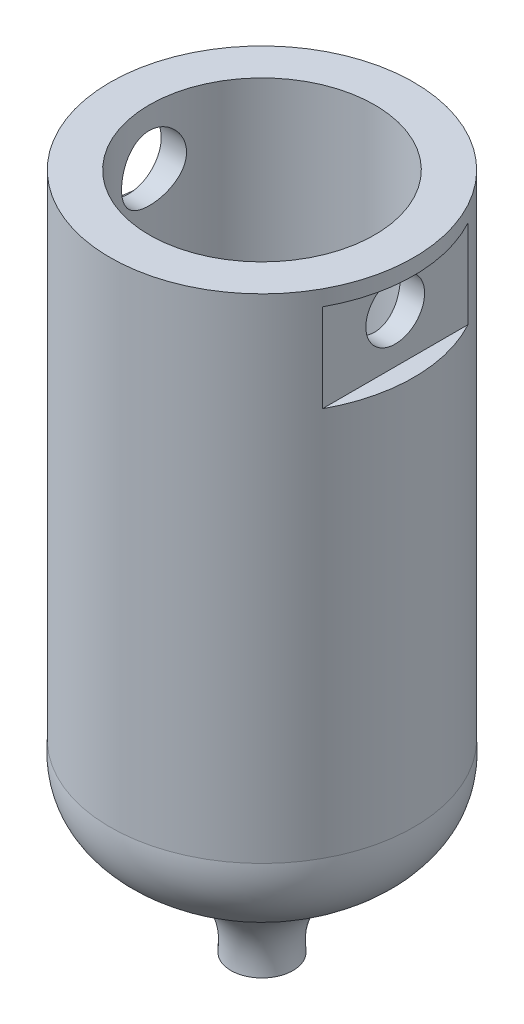
ISO-10303-21;
HEADER;
FILE_DESCRIPTION(('STEP AP214'),'2;1');
FILE_NAME('part.step','',(''),(''),'','','');
FILE_SCHEMA(('AUTOMOTIVE_DESIGN { 1 0 10303 214 1 1 1 1 }'));
ENDSEC;
DATA;
#1=APPLICATION_CONTEXT('core data for automotive mechanical design processes');
#2=APPLICATION_PROTOCOL_DEFINITION('international standard','automotive_design',2000,#1);
#3=PRODUCT_CONTEXT('',#1,'mechanical');
#4=PRODUCT('Part','Part','',(#3));
#5=PRODUCT_RELATED_PRODUCT_CATEGORY('part','',(#4));
#6=PRODUCT_DEFINITION_FORMATION('','',#4);
#7=PRODUCT_DEFINITION_CONTEXT('part definition',#1,'design');
#8=PRODUCT_DEFINITION('design','',#6,#7);
#9=PRODUCT_DEFINITION_SHAPE('','',#8);
#10=(LENGTH_UNIT() NAMED_UNIT(*) SI_UNIT(.MILLI.,.METRE.));
#11=(NAMED_UNIT(*) PLANE_ANGLE_UNIT() SI_UNIT($,.RADIAN.));
#12=(NAMED_UNIT(*) SI_UNIT($,.STERADIAN.) SOLID_ANGLE_UNIT());
#13=UNCERTAINTY_MEASURE_WITH_UNIT(LENGTH_MEASURE(1.E-05),#10,'distance_accuracy_value','');
#14=(GEOMETRIC_REPRESENTATION_CONTEXT(3) GLOBAL_UNCERTAINTY_ASSIGNED_CONTEXT((#13)) GLOBAL_UNIT_ASSIGNED_CONTEXT((#10,
#11,#12)) REPRESENTATION_CONTEXT('',''));
#15=CARTESIAN_POINT('',(0.,0.,0.));
#16=DIRECTION('',(0.,0.,1.));
#17=DIRECTION('',(1.,0.,0.));
#18=AXIS2_PLACEMENT_3D('',#15,#16,#17);
#19=CARTESIAN_POINT('',(3.87911139565885,0.,0.));
#20=DIRECTION('',(0.,1.,0.));
#21=DIRECTION('',(-1.,0.,0.));
#22=AXIS2_PLACEMENT_3D('',#19,#20,#21);
#23=CYLINDRICAL_SURFACE('',#22,3.87911139565885);
#24=CARTESIAN_POINT('',(3.87911139565885,-0.398291517069069,0.));
#25=DIRECTION('',(0.,1.,0.));
#26=DIRECTION('',(0.,0.,1.));
#27=AXIS2_PLACEMENT_3D('',#24,#25,#26);
#28=CIRCLE('',#27,3.87911139565885);
#29=CARTESIAN_POINT('',(0.4751582348114,-0.398291517069069,1.86027097453221));
#30=VERTEX_POINT('',#29);
#31=CARTESIAN_POINT('',(0.4751582348114,-0.398291517069069,-1.86027097453221));
#32=VERTEX_POINT('',#31);
#33=EDGE_CURVE('E13',#30,#32,#28,.F.);
#34=ORIENTED_EDGE('',*,*,#33,.F.);
#35=DIRECTION('',(0.,1.,0.));
#36=VECTOR('',#35,1.);
#37=CARTESIAN_POINT('',(0.4751582348114,0.,1.86027097453221));
#38=LINE('',#37,#36);
#39=CARTESIAN_POINT('',(0.4751582348114,-2.65224190350356,1.86027097453221));
#40=VERTEX_POINT('',#39);
#41=EDGE_CURVE('E99',#40,#30,#38,.T.);
#42=ORIENTED_EDGE('',*,*,#41,.F.);
#43=CARTESIAN_POINT('',(3.87911139565885,-2.65224190350356,0.));
#44=DIRECTION('',(0.,1.,0.));
#45=DIRECTION('',(0.,0.,1.));
#46=AXIS2_PLACEMENT_3D('',#43,#44,#45);
#47=CIRCLE('',#46,3.87911139565885);
#48=CARTESIAN_POINT('',(0.4751582348114,-2.65224190350356,-1.86027097453221));
#49=VERTEX_POINT('',#48);
#50=EDGE_CURVE('E59',#40,#49,#47,.F.);
#51=ORIENTED_EDGE('',*,*,#50,.T.);
#52=DIRECTION('',(0.,1.,0.));
#53=VECTOR('',#52,1.);
#54=CARTESIAN_POINT('',(0.4751582348114,0.,-1.86027097453221));
#55=LINE('',#54,#53);
#56=EDGE_CURVE('E101',#32,#49,#55,.F.);
#57=ORIENTED_EDGE('',*,*,#56,.F.);
#58=EDGE_LOOP('',(#34,#42,#51,#57));
#59=FACE_BOUND('',#58,.T.);
#60=CARTESIAN_POINT('',(3.87911139565885,0.,0.));
#61=DIRECTION('',(0.,1.,0.));
#62=DIRECTION('',(-1.,0.,0.));
#63=AXIS2_PLACEMENT_3D('',#60,#61,#62);
#64=CIRCLE('',#63,3.87911139565885);
#65=CARTESIAN_POINT('',(0.,0.,0.));
#66=VERTEX_POINT('',#65);
#67=EDGE_CURVE('E196',#66,#66,#64,.T.);
#68=ORIENTED_EDGE('',*,*,#67,.F.);
#69=EDGE_LOOP('',(#68));
#70=FACE_BOUND('',#69,.T.);
#71=CARTESIAN_POINT('',(3.87911139565885,-12.6027502968154,0.));
#72=DIRECTION('',(0.,1.,0.));
#73=DIRECTION('',(-1.,0.,0.));
#74=AXIS2_PLACEMENT_3D('',#71,#72,#73);
#75=CIRCLE('',#74,3.87911139565885);
#76=CARTESIAN_POINT('',(0.,-12.6027502968154,0.));
#77=VERTEX_POINT('',#76);
#78=EDGE_CURVE('E167',#77,#77,#75,.T.);
#79=ORIENTED_EDGE('',*,*,#78,.T.);
#80=EDGE_LOOP('',(#79));
#81=FACE_BOUND('',#80,.T.);
#82=DIRECTION('',(0.,1.,0.));
#83=VECTOR('',#82,1.);
#84=CARTESIAN_POINT('',(7.28306455650629,0.,1.86027097453221));
#85=LINE('',#84,#83);
#86=CARTESIAN_POINT('',(7.28306455650629,-2.65224190350356,1.86027097453221));
#87=VERTEX_POINT('',#86);
#88=CARTESIAN_POINT('',(7.28306455650629,-0.398291517069069,1.86027097453221));
#89=VERTEX_POINT('',#88);
#90=EDGE_CURVE('E115',#87,#89,#85,.T.);
#91=ORIENTED_EDGE('',*,*,#90,.T.);
#92=CARTESIAN_POINT('',(3.87911139565885,-0.398291517069069,0.));
#93=DIRECTION('',(0.,-1.,0.));
#94=DIRECTION('',(0.,0.,-1.));
#95=AXIS2_PLACEMENT_3D('',#92,#93,#94);
#96=CIRCLE('',#95,3.87911139565885);
#97=CARTESIAN_POINT('',(7.28306455650629,-0.398291517069069,-1.86027097453221));
#98=VERTEX_POINT('',#97);
#99=EDGE_CURVE('E93',#89,#98,#96,.F.);
#100=ORIENTED_EDGE('',*,*,#99,.T.);
#101=DIRECTION('',(0.,1.,0.));
#102=VECTOR('',#101,1.);
#103=CARTESIAN_POINT('',(7.28306455650629,0.,-1.86027097453221));
#104=LINE('',#103,#102);
#105=CARTESIAN_POINT('',(7.28306455650629,-2.65224190350356,-1.86027097453221));
#106=VERTEX_POINT('',#105);
#107=EDGE_CURVE('E118',#98,#106,#104,.F.);
#108=ORIENTED_EDGE('',*,*,#107,.T.);
#109=CARTESIAN_POINT('',(3.87911139565885,-2.65224190350356,0.));
#110=DIRECTION('',(0.,-1.,0.));
#111=DIRECTION('',(0.,0.,-1.));
#112=AXIS2_PLACEMENT_3D('',#109,#110,#111);
#113=CIRCLE('',#112,3.87911139565885);
#114=EDGE_CURVE('E72',#87,#106,#113,.F.);
#115=ORIENTED_EDGE('',*,*,#114,.F.);
#116=EDGE_LOOP('',(#91,#100,#108,#115));
#117=FACE_BOUND('',#116,.T.);
#118=ADVANCED_FACE('F51',(#59,#70,#81,#117),#23,.T.);
#119=CARTESIAN_POINT('',(7.86678635657434,-1.4,0.));
#120=DIRECTION('',(-1.,0.,0.));
#121=DIRECTION('',(0.,0.,1.));
#122=AXIS2_PLACEMENT_3D('',#119,#120,#121);
#123=CYLINDRICAL_SURFACE('',#122,0.75);
#124=CARTESIAN_POINT('',(6.65882045032853,-1.4,0.75));
#125=CARTESIAN_POINT('',(6.65882119880354,-1.44135349528741,0.749998932822332));
#126=CARTESIAN_POINT('',(6.65975335386513,-1.48271847313385,0.746568125114935));
#127=CARTESIAN_POINT('',(6.66337072069618,-1.56425635398648,0.732959987670562));
#128=CARTESIAN_POINT('',(6.6660568646868,-1.60442861120117,0.722779070298178));
#129=CARTESIAN_POINT('',(6.6728578069925,-1.68238978173006,0.696026009763756));
#130=CARTESIAN_POINT('',(6.67697065805547,-1.72018186100288,0.679462574432692));
#131=CARTESIAN_POINT('',(6.6861591386787,-1.7924560729811,0.640441655099534));
#132=CARTESIAN_POINT('',(6.69123483037439,-1.82693799185403,0.61798379067372));
#133=CARTESIAN_POINT('',(6.70191284071499,-1.8924363767938,0.567238359369834));
#134=CARTESIAN_POINT('',(6.70752415267262,-1.92336212206658,0.538835565583466));
#135=CARTESIAN_POINT('',(6.71856337996475,-1.98006934906218,0.477254483854455));
#136=CARTESIAN_POINT('',(6.72399127696103,-2.00585031765542,0.444075720133778));
#137=CARTESIAN_POINT('',(6.73415213128276,-2.05191177672447,0.373258303069614));
#138=CARTESIAN_POINT('',(6.73887324070978,-2.07210247877457,0.335559401669255));
#139=CARTESIAN_POINT('',(6.74698561175101,-2.10582536169043,0.257158800112188));
#140=CARTESIAN_POINT('',(6.75037708696479,-2.11935861213394,0.216457583512703));
#141=CARTESIAN_POINT('',(6.75538447647621,-2.13908996238119,0.134154217452736));
#142=CARTESIAN_POINT('',(6.75703766713196,-2.14544228655516,0.092591349090958));
#143=CARTESIAN_POINT('',(6.75851238634948,-2.15111626192085,0.0089591859760001));
#144=CARTESIAN_POINT('',(6.75833420798658,-2.15043903805616,-0.0331100266702675));
#145=CARTESIAN_POINT('',(6.75619374189036,-2.1421826207213,-0.115488670732327));
#146=CARTESIAN_POINT('',(6.75427451223138,-2.13476999385245,-0.1558160849777));
#147=CARTESIAN_POINT('',(6.74891814376107,-2.11352176933159,-0.234633615664966));
#148=CARTESIAN_POINT('',(6.74548092045753,-2.09968581415205,-0.27312362970418));
#149=CARTESIAN_POINT('',(6.73741015312004,-2.06585335801709,-0.347604110621959));
#150=CARTESIAN_POINT('',(6.73276543479417,-2.04579895763203,-0.38356701630567));
#151=CARTESIAN_POINT('',(6.72278141088435,-2.00014312178746,-0.451674466730828));
#152=CARTESIAN_POINT('',(6.7174419754019,-1.97454064834965,-0.483818295223832));
#153=CARTESIAN_POINT('',(6.70646359025384,-1.91762790088388,-0.544369083773024));
#154=CARTESIAN_POINT('',(6.70082044909128,-1.8861722383292,-0.57263878546034));
#155=CARTESIAN_POINT('',(6.69001272842405,-1.81890789492738,-0.623534259039739));
#156=CARTESIAN_POINT('',(6.68484817542155,-1.78309897326876,-0.646159718494882));
#157=CARTESIAN_POINT('',(6.6755662267654,-1.70785771645531,-0.685222609774015));
#158=CARTESIAN_POINT('',(6.67145491324556,-1.66840604970982,-0.701624352146578));
#159=CARTESIAN_POINT('',(6.66482137434786,-1.58717170291734,-0.727518367029426));
#160=CARTESIAN_POINT('',(6.66229877551632,-1.5453895731999,-0.737012263424763));
#161=CARTESIAN_POINT('',(6.65920740614091,-1.46195996793276,-0.748587832983731));
#162=CARTESIAN_POINT('',(6.65858486034682,-1.42034276649008,-0.750873575019136));
#163=CARTESIAN_POINT('',(6.65921723807557,-1.33732109305741,-0.748528856378479));
#164=CARTESIAN_POINT('',(6.66047197209659,-1.29591660001892,-0.743899093787473));
#165=CARTESIAN_POINT('',(6.66466574433227,-1.2152711219597,-0.72803433170915));
#166=CARTESIAN_POINT('',(6.66757385040019,-1.17600452846983,-0.71692054150522));
#167=CARTESIAN_POINT('',(6.67471679825483,-1.09989231443232,-0.688538771622486));
#168=CARTESIAN_POINT('',(6.67895180734557,-1.06304699988335,-0.671270015850389));
#169=CARTESIAN_POINT('',(6.68838282841374,-0.991965360988862,-0.630649394903851));
#170=CARTESIAN_POINT('',(6.69359723053203,-0.957800481980292,-0.607176874964182));
#171=CARTESIAN_POINT('',(6.70435554790995,-0.893819523698517,-0.554965709478623));
#172=CARTESIAN_POINT('',(6.70989952205081,-0.864004224826041,-0.52622612099837));
#173=CARTESIAN_POINT('',(6.72087636244359,-0.808729391371596,-0.463355485690878));
#174=CARTESIAN_POINT('',(6.72630201175189,-0.783411738870419,-0.42909819388663));
#175=CARTESIAN_POINT('',(6.73627434199777,-0.738887259231366,-0.356700857902372));
#176=CARTESIAN_POINT('',(6.74082106953015,-0.719680108118965,-0.31856101971384));
#177=CARTESIAN_POINT('',(6.74849411687009,-0.688094937798406,-0.239748738339916));
#178=CARTESIAN_POINT('',(6.75163089016136,-0.675666508742994,-0.199097564130698));
#179=CARTESIAN_POINT('',(6.75617652120192,-0.657843263564819,-0.116190260634539));
#180=CARTESIAN_POINT('',(6.7575857430913,-0.652446965166685,-0.0739344715113141));
#181=CARTESIAN_POINT('',(6.75850117215974,-0.648930472924837,0.00965431455257707));
#182=CARTESIAN_POINT('',(6.75806193589369,-0.650601691197902,0.0509780662815975));
#183=CARTESIAN_POINT('',(6.75545227550542,-0.660690944820821,0.132734710726078));
#184=CARTESIAN_POINT('',(6.75328191115378,-0.669108747231758,0.173167634149592));
#185=CARTESIAN_POINT('',(6.74746379970355,-0.692336496895685,0.251756212138704));
#186=CARTESIAN_POINT('',(6.74382544416206,-0.707105848585073,0.289924606252872));
#187=CARTESIAN_POINT('',(6.73545277631945,-0.742581036434942,0.363263338885613));
#188=CARTESIAN_POINT('',(6.73071831593897,-0.76328767478916,0.398433271444944));
#189=CARTESIAN_POINT('',(6.72050980607137,-0.810669805390412,0.465754686744342));
#190=CARTESIAN_POINT('',(6.71501989601932,-0.837484824892129,0.497805558482382));
#191=CARTESIAN_POINT('',(6.70398604319128,-0.896055549913899,0.557023275044412));
#192=CARTESIAN_POINT('',(6.69844208677189,-0.927812534927784,0.584188851109277));
#193=CARTESIAN_POINT('',(6.68779617551429,-0.996157308506286,0.633420242895366));
#194=CARTESIAN_POINT('',(6.6827057545219,-1.03283153365543,0.655368771064496));
#195=CARTESIAN_POINT('',(6.67370310672691,-1.10947738626351,0.692756759510287));
#196=CARTESIAN_POINT('',(6.6697900767068,-1.14944674195768,0.708200660139967));
#197=CARTESIAN_POINT('',(6.66415452539263,-1.22441563481377,0.730013845634422));
#198=CARTESIAN_POINT('',(6.66216999728521,-1.25907699038448,0.737491540540258));
#199=CARTESIAN_POINT('',(6.65950270585416,-1.32915614030162,0.747484820589903));
#200=CARTESIAN_POINT('',(6.65881980913527,-1.36457385675757,0.750000914215079));
#201=CARTESIAN_POINT('',(6.65882045032853,-1.4,0.75));
#202=B_SPLINE_CURVE_WITH_KNOTS('',3,(#124,#125,#126,#127,#128,#129,#130,#131,#132,#133,#134,
#135,#136,#137,#138,#139,#140,#141,#142,#143,#144,#145,#146,#147,#148,#149,#150,#151,#152,#153,
#154,#155,#156,#157,#158,#159,#160,#161,#162,#163,#164,#165,#166,#167,#168,#169,#170,#171,#172,
#173,#174,#175,#176,#177,#178,#179,#180,#181,#182,#183,#184,#185,#186,#187,#188,#189,#190,#191,
#192,#193,#194,#195,#196,#197,#198,#199,#200,#201),.UNSPECIFIED.,.T.,.F.,(4,2,2,2,2,2,2,2,2,2,2,
2,2,2,2,2,2,2,2,2,2,2,2,2,2,2,2,2,2,2,2,2,2,2,2,2,2,2,4),(0.,0.123930284377685,
0.247926489680875,0.371754119385737,0.495589742834374,0.622094694105621,0.74861225642447,
0.877057409287917,1.00548191957071,1.13109249966966,1.25668297852772,1.37924970070714,
1.50182324586515,1.62557418972404,1.74934830592799,1.87675281216132,2.00416436930496,
2.13229589733076,2.26039729466787,2.38483788409341,2.50926591272257,2.63143926357754,
2.75362802499502,2.87839472691826,3.00318378699701,3.13139519216709,3.25959979852449,
3.38683754316207,3.51404846351162,3.63753154298587,3.76101035915069,3.88371143077,
4.00642908849255,4.1322956926091,4.25819493845531,4.38670196396389,4.51512112201841,
4.62129889454589,4.72746578505722),.UNSPECIFIED.);
#203=CARTESIAN_POINT('',(6.65882045032853,-1.4,0.75));
#204=VERTEX_POINT('',#203);
#205=EDGE_CURVE('E128',#204,#204,#202,.T.);
#206=ORIENTED_EDGE('',*,*,#205,.F.);
#207=EDGE_LOOP('',(#206));
#208=FACE_BOUND('',#207,.T.);
#209=CARTESIAN_POINT('',(7.28306455650629,-1.4,0.));
#210=DIRECTION('',(1.,0.,0.));
#211=DIRECTION('',(0.,0.,-1.));
#212=AXIS2_PLACEMENT_3D('',#209,#210,#211);
#213=CIRCLE('',#212,0.75);
#214=CARTESIAN_POINT('',(7.28306455650629,-1.4,-0.75));
#215=VERTEX_POINT('',#214);
#216=EDGE_CURVE('E108',#215,#215,#213,.T.);
#217=ORIENTED_EDGE('',*,*,#216,.T.);
#218=EDGE_LOOP('',(#217));
#219=FACE_BOUND('',#218,.T.);
#220=ADVANCED_FACE('F145',(#208,#219),#123,.F.);
#221=CARTESIAN_POINT('',(3.87911139565885,0.,0.));
#222=DIRECTION('',(0.,1.,0.));
#223=DIRECTION('',(-1.,0.,0.));
#224=AXIS2_PLACEMENT_3D('',#221,#222,#223);
#225=CYLINDRICAL_SURFACE('',#224,2.87911139565885);
#226=ORIENTED_EDGE('',*,*,#205,.T.);
#227=EDGE_LOOP('',(#226));
#228=FACE_BOUND('',#227,.T.);
#229=CARTESIAN_POINT('',(3.87911139565885,0.,0.));
#230=DIRECTION('',(0.,1.,0.));
#231=DIRECTION('',(-1.,0.,0.));
#232=AXIS2_PLACEMENT_3D('',#229,#230,#231);
#233=CIRCLE('',#232,2.87911139565885);
#234=CARTESIAN_POINT('',(1.,0.,0.));
#235=VERTEX_POINT('',#234);
#236=EDGE_CURVE('E190',#235,#235,#233,.T.);
#237=ORIENTED_EDGE('',*,*,#236,.T.);
#238=EDGE_LOOP('',(#237));
#239=FACE_BOUND('',#238,.T.);
#240=CARTESIAN_POINT('',(3.87911139565885,-12.6027502968154,0.));
#241=DIRECTION('',(0.,1.,0.));
#242=DIRECTION('',(-1.,0.,0.));
#243=AXIS2_PLACEMENT_3D('',#240,#241,#242);
#244=CIRCLE('',#243,2.87911139565885);
#245=CARTESIAN_POINT('',(1.,-12.6027502968154,0.));
#246=VERTEX_POINT('',#245);
#247=EDGE_CURVE('E184',#246,#246,#244,.T.);
#248=ORIENTED_EDGE('',*,*,#247,.F.);
#249=EDGE_LOOP('',(#248));
#250=FACE_BOUND('',#249,.T.);
#251=CARTESIAN_POINT('',(0.999999999999999,-2.23004370605977,0.));
#252=CARTESIAN_POINT('',(1.00000051789833,-2.23004294400898,0.0456162265267917));
#253=CARTESIAN_POINT('',(1.00109458213942,-2.2262708252045,0.0912402537332508));
#254=CARTESIAN_POINT('',(1.00535238101256,-2.21131449401277,0.181164847594669));
#255=CARTESIAN_POINT('',(1.00851686921078,-2.20012758286581,0.225464926234744));
#256=CARTESIAN_POINT('',(1.01656784719707,-2.17074245982049,0.311431272398982));
#257=CARTESIAN_POINT('',(1.02145191027986,-2.15255412514002,0.353101154495086));
#258=CARTESIAN_POINT('',(1.03243133131071,-2.10972156692174,0.43279961309193));
#259=CARTESIAN_POINT('',(1.03852682221687,-2.08507663465697,0.47082778922422));
#260=CARTESIAN_POINT('',(1.05145817702849,-2.02933597513728,0.543179548898169));
#261=CARTESIAN_POINT('',(1.05830832304515,-1.99809933990227,0.57739201927089));
#262=CARTESIAN_POINT('',(1.07188942945109,-1.93036259489801,0.640172713186054));
#263=CARTESIAN_POINT('',(1.07862037144984,-1.89386168077532,0.668740072602127));
#264=CARTESIAN_POINT('',(1.09135019813459,-1.81571178360595,0.719988553998694));
#265=CARTESIAN_POINT('',(1.09733123259573,-1.77397255260746,0.742536902062953));
#266=CARTESIAN_POINT('',(1.1076718319276,-1.68709464035266,0.780250142412678));
#267=CARTESIAN_POINT('',(1.11203175270174,-1.64195670787575,0.795416655551117));
#268=CARTESIAN_POINT('',(1.11848814195646,-1.55080445769595,0.81754038776023));
#269=CARTESIAN_POINT('',(1.12064063943738,-1.50484363973935,0.824701256977832));
#270=CARTESIAN_POINT('',(1.12260542030173,-1.4123264789544,0.831246018634678));
#271=CARTESIAN_POINT('',(1.1224182224306,-1.36577027041972,0.830631634963381));
#272=CARTESIAN_POINT('',(1.11977459882835,-1.27501518697652,0.821803908707768));
#273=CARTESIAN_POINT('',(1.11739339661978,-1.23078926230635,0.813842453341343));
#274=CARTESIAN_POINT('',(1.11075130762475,-1.14432940560988,0.79095225927017));
#275=CARTESIAN_POINT('',(1.1064902481466,-1.102095656988,0.776022880455037));
#276=CARTESIAN_POINT('',(1.09650633586141,-1.02018829103384,0.739428045183161));
#277=CARTESIAN_POINT('',(1.09076540742933,-0.980554532130943,0.717678517958584));
#278=CARTESIAN_POINT('',(1.0784776738556,-0.905413356109098,0.668119272118071));
#279=CARTESIAN_POINT('',(1.07193068659427,-0.869906875036878,0.6403081828649));
#280=CARTESIAN_POINT('',(1.05846049520185,-0.802595541581199,0.578150826773266));
#281=CARTESIAN_POINT('',(1.05153249905824,-0.770985228268864,0.543594590800327));
#282=CARTESIAN_POINT('',(1.03830467430272,-0.713964956970097,0.469585650113612));
#283=CARTESIAN_POINT('',(1.03200487944342,-0.688555332034238,0.430132682558847));
#284=CARTESIAN_POINT('',(1.02069299047211,-0.644551637151926,0.347115744023262));
#285=CARTESIAN_POINT('',(1.01568855171132,-0.625997820327446,0.3035293241981));
#286=CARTESIAN_POINT('',(1.00758639972422,-0.596539905582236,0.213677588362203));
#287=CARTESIAN_POINT('',(1.00448819686443,-0.5856338431677,0.167412963615233));
#288=CARTESIAN_POINT('',(1.00062381906252,-0.572098167660569,0.0751742263412322));
#289=CARTESIAN_POINT('',(0.999783300940902,-0.56920460833687,0.0292419027548738));
#290=CARTESIAN_POINT('',(1.00031247731239,-0.571040229008348,-0.0624535881781671));
#291=CARTESIAN_POINT('',(1.0016819013516,-0.575768476242682,-0.108216775536887));
#292=CARTESIAN_POINT('',(1.00642863380961,-0.592498843137612,-0.197298407667442));
#293=CARTESIAN_POINT('',(1.00976404394352,-0.60434927830618,-0.240647781784955));
#294=CARTESIAN_POINT('',(1.01805987698296,-0.634807451306274,-0.324735717554167));
#295=CARTESIAN_POINT('',(1.02302048924548,-0.653415976569864,-0.365473974315405));
#296=CARTESIAN_POINT('',(1.03418483694939,-0.697321867840418,-0.444174334456727));
#297=CARTESIAN_POINT('',(1.04041343933792,-0.722756918929106,-0.4820560050662));
#298=CARTESIAN_POINT('',(1.05339653922041,-0.779424521344533,-0.55310446671272));
#299=CARTESIAN_POINT('',(1.06015115832073,-0.810658415591731,-0.586270162456347));
#300=CARTESIAN_POINT('',(1.07370621131314,-0.879274935035472,-0.648089796106412));
#301=CARTESIAN_POINT('',(1.08050066160941,-0.916827870115664,-0.676556397867835));
#302=CARTESIAN_POINT('',(1.09312382239925,-0.996324479523021,-0.726793687091738));
#303=CARTESIAN_POINT('',(1.09895256521836,-1.03826800680524,-0.748564598702899));
#304=CARTESIAN_POINT('',(1.10891634590504,-1.12518758746848,-0.784635161482458));
#305=CARTESIAN_POINT('',(1.11306016968889,-1.17014644776136,-0.798973679035879));
#306=CARTESIAN_POINT('',(1.11917218922634,-1.26198027153956,-0.819840537041089));
#307=CARTESIAN_POINT('',(1.12114105923565,-1.30885463652515,-0.826371298021061));
#308=CARTESIAN_POINT('',(1.12261739796789,-1.40125336986466,-0.831281524905158));
#309=CARTESIAN_POINT('',(1.12221658993451,-1.44676035309946,-0.829964730317832));
#310=CARTESIAN_POINT('',(1.1192171742454,-1.53687423386724,-0.819934828553056));
#311=CARTESIAN_POINT('',(1.11661864244081,-1.58148116240985,-0.811221976639388));
#312=CARTESIAN_POINT('',(1.10957567047184,-1.66807387917729,-0.786836436287827));
#313=CARTESIAN_POINT('',(1.10515104416619,-1.71008239999593,-0.77123833294208));
#314=CARTESIAN_POINT('',(1.09495668127078,-1.79091944473096,-0.733582795924712));
#315=CARTESIAN_POINT('',(1.08918670308744,-1.82974739579751,-0.71152420191848));
#316=CARTESIAN_POINT('',(1.076707327538,-1.90454544302859,-0.660696399717511));
#317=CARTESIAN_POINT('',(1.06997269743541,-1.94037386265666,-0.631724886647513));
#318=CARTESIAN_POINT('',(1.05645167361359,-2.00675906301161,-0.568265224568573));
#319=CARTESIAN_POINT('',(1.04966526722203,-2.03731450693138,-0.53377568088441));
#320=CARTESIAN_POINT('',(1.0365917015021,-2.09308294221173,-0.459166552720328));
#321=CARTESIAN_POINT('',(1.0303223468836,-2.11813445109226,-0.418922841524296));
#322=CARTESIAN_POINT('',(1.01919553618781,-2.1610789299946,-0.334614145974345));
#323=CARTESIAN_POINT('',(1.01433732838227,-2.17897571331042,-0.290551212451988));
#324=CARTESIAN_POINT('',(1.00707968939491,-2.20522888175736,-0.205656664934965));
#325=CARTESIAN_POINT('',(1.00444577661941,-2.21451058545737,-0.165129118397113));
#326=CARTESIAN_POINT('',(1.00090581649466,-2.2269179157061,-0.0830697768336155));
#327=CARTESIAN_POINT('',(0.999999528401926,-2.230044399983,-0.0415381225467237));
#328=CARTESIAN_POINT('',(0.999999999999999,-2.23004370605977,0.));
#329=B_SPLINE_CURVE_WITH_KNOTS('',3,(#251,#252,#253,#254,#255,#256,#257,#258,#259,#260,#261,
#262,#263,#264,#265,#266,#267,#268,#269,#270,#271,#272,#273,#274,#275,#276,#277,#278,#279,#280,
#281,#282,#283,#284,#285,#286,#287,#288,#289,#290,#291,#292,#293,#294,#295,#296,#297,#298,#299,
#300,#301,#302,#303,#304,#305,#306,#307,#308,#309,#310,#311,#312,#313,#314,#315,#316,#317,#318,
#319,#320,#321,#322,#323,#324,#325,#326,#327,#328),.UNSPECIFIED.,.T.,.F.,(4,2,2,2,2,2,2,2,2,2,2,
2,2,2,2,2,2,2,2,2,2,2,2,2,2,2,2,2,2,2,2,2,2,2,2,2,2,2,4),(0.,0.136696191830502,
0.273442164273573,0.409995925967183,0.546564683161242,0.68641846497896,0.826293638383829,
0.969038246874202,1.11175149832133,1.25074533694611,1.38970835910508,1.52407737039437,
1.65845872796372,1.7945664067594,1.93070489414084,2.07207194846244,2.21344659420257,
2.35563859060101,2.4977940484672,2.63520755569993,2.7726042474694,2.90717358000402,
3.04175859718036,3.17929387458429,3.31686104280549,3.45901569529359,3.60116558841466,
3.74256443800184,3.88391944032987,4.01983976219803,4.15575539317166,4.29023351740102,
4.42473580936313,4.56380198543004,4.70290336598488,4.84565993171337,4.98834030991662,
5.11283317153137,5.23730868387106),.UNSPECIFIED.);
#330=CARTESIAN_POINT('',(0.999999999999999,-2.23004370605977,0.));
#331=VERTEX_POINT('',#330);
#332=EDGE_CURVE('E121',#331,#331,#329,.T.);
#333=ORIENTED_EDGE('',*,*,#332,.T.);
#334=EDGE_LOOP('',(#333));
#335=FACE_BOUND('',#334,.T.);
#336=ADVANCED_FACE('F134',(#228,#239,#250,#335),#225,.F.);
#337=CARTESIAN_POINT('',(0.,0.,0.));
#338=DIRECTION('',(0.,1.,0.));
#339=DIRECTION('',(-1.,0.,0.));
#340=AXIS2_PLACEMENT_3D('',#337,#338,#339);
#341=PLANE('',#340);
#342=ORIENTED_EDGE('',*,*,#67,.T.);
#343=EDGE_LOOP('',(#342));
#344=FACE_BOUND('',#343,.T.);
#345=ORIENTED_EDGE('',*,*,#236,.F.);
#346=EDGE_LOOP('',(#345));
#347=FACE_BOUND('',#346,.T.);
#348=ADVANCED_FACE('F53',(#344,#347),#341,.T.);
#349=CARTESIAN_POINT('',(3.45632985032101,-17.316571149834,0.));
#350=CARTESIAN_POINT('',(3.35644004332822,-16.6776758579548,0.));
#351=CARTESIAN_POINT('',(4.05254849436356,-14.1585929738283,0.));
#352=CARTESIAN_POINT('',(0.798438660157824,-14.1894687342172,0.));
#353=CARTESIAN_POINT('',(1.,-12.6027502968154,0.));
#354=B_SPLINE_CURVE_WITH_KNOTS('',3,(#349,#350,#351,#352,#353),.UNSPECIFIED.,.F.,.F.,(4,1,4),
(0.,0.389406152179462,1.),.UNSPECIFIED.);
#355=CARTESIAN_POINT('',(3.87911139565885,0.,0.));
#356=DIRECTION('',(0.,1.,0.));
#357=AXIS1_PLACEMENT('',#355,#356);
#358=SURFACE_OF_REVOLUTION('',#354,#357);
#359=ORIENTED_EDGE('',*,*,#247,.T.);
#360=EDGE_LOOP('',(#359));
#361=FACE_BOUND('',#360,.T.);
#362=CARTESIAN_POINT('',(3.87911139565885,-17.316571149834,0.));
#363=DIRECTION('',(0.,1.,0.));
#364=DIRECTION('',(-1.,0.,0.));
#365=AXIS2_PLACEMENT_3D('',#362,#363,#364);
#366=CIRCLE('',#365,0.422781545337843);
#367=CARTESIAN_POINT('',(3.45632985032101,-17.316571149834,0.));
#368=VERTEX_POINT('',#367);
#369=EDGE_CURVE('E187',#368,#368,#366,.T.);
#370=ORIENTED_EDGE('',*,*,#369,.F.);
#371=EDGE_LOOP('',(#370));
#372=FACE_BOUND('',#371,.T.);
#373=ADVANCED_FACE('F172',(#361,#372),#358,.F.);
#374=CARTESIAN_POINT('',(3.08404425843277,-17.316571149834,0.));
#375=DIRECTION('',(0.,-1.,0.));
#376=DIRECTION('',(1.,0.,0.));
#377=AXIS2_PLACEMENT_3D('',#374,#375,#376);
#378=PLANE('',#377);
#379=ORIENTED_EDGE('',*,*,#369,.T.);
#380=EDGE_LOOP('',(#379));
#381=FACE_BOUND('',#380,.T.);
#382=CARTESIAN_POINT('',(3.87911139565885,-17.316571149834,0.));
#383=DIRECTION('',(0.,1.,0.));
#384=DIRECTION('',(-1.,0.,0.));
#385=AXIS2_PLACEMENT_3D('',#382,#383,#384);
#386=CIRCLE('',#385,0.795067137226076);
#387=CARTESIAN_POINT('',(3.08404425843277,-17.316571149834,0.));
#388=VERTEX_POINT('',#387);
#389=EDGE_CURVE('E188',#388,#388,#386,.T.);
#390=ORIENTED_EDGE('',*,*,#389,.F.);
#391=EDGE_LOOP('',(#390));
#392=FACE_BOUND('',#391,.T.);
#393=ADVANCED_FACE('F154',(#381,#392),#378,.T.);
#394=CARTESIAN_POINT('',(0.,-12.6027502968154,0.));
#395=CARTESIAN_POINT('',(-0.217127130513288,-15.2491799654516,0.));
#396=CARTESIAN_POINT('',(3.34176134757971,-14.7278091659304,0.));
#397=CARTESIAN_POINT('',(3.08404425843277,-17.316571149834,0.));
#398=B_SPLINE_CURVE_WITH_KNOTS('',3,(#394,#395,#396,#397),.UNSPECIFIED.,.F.,.F.,(4,4),(0.,1.),.UNSPECIFIED.);
#399=CARTESIAN_POINT('',(3.87911139565885,0.,0.));
#400=DIRECTION('',(0.,1.,0.));
#401=AXIS1_PLACEMENT('',#399,#400);
#402=SURFACE_OF_REVOLUTION('',#398,#401);
#403=ORIENTED_EDGE('',*,*,#389,.T.);
#404=EDGE_LOOP('',(#403));
#405=FACE_BOUND('',#404,.T.);
#406=ORIENTED_EDGE('',*,*,#78,.F.);
#407=EDGE_LOOP('',(#406));
#408=FACE_BOUND('',#407,.T.);
#409=ADVANCED_FACE('F141',(#405,#408),#402,.F.);
#410=CARTESIAN_POINT('',(4.9791114,-1.4,0.));
#411=DIRECTION('',(-1.,0.,0.));
#412=DIRECTION('',(0.,0.,1.));
#413=AXIS2_PLACEMENT_3D('',#410,#411,#412);
#414=CYLINDRICAL_SURFACE('',#413,0.830043706059769);
#415=CARTESIAN_POINT('',(0.4751582348114,-1.4,0.));
#416=DIRECTION('',(1.,0.,0.));
#417=DIRECTION('',(0.,0.,-1.));
#418=AXIS2_PLACEMENT_3D('',#415,#416,#417);
#419=CIRCLE('',#418,0.830043706059769);
#420=CARTESIAN_POINT('',(0.4751582348114,-1.4,-0.830043706059769));
#421=VERTEX_POINT('',#420);
#422=EDGE_CURVE('E106',#421,#421,#419,.T.);
#423=ORIENTED_EDGE('',*,*,#422,.F.);
#424=EDGE_LOOP('',(#423));
#425=FACE_BOUND('',#424,.T.);
#426=ORIENTED_EDGE('',*,*,#332,.F.);
#427=EDGE_LOOP('',(#426));
#428=FACE_BOUND('',#427,.T.);
#429=ADVANCED_FACE('F137',(#425,#428),#414,.F.);
#430=CARTESIAN_POINT('',(0.4751582348114,0.,10.));
#431=DIRECTION('',(1.,0.,0.));
#432=DIRECTION('',(0.,0.,-1.));
#433=AXIS2_PLACEMENT_3D('',#430,#431,#432);
#434=PLANE('',#433);
#435=ORIENTED_EDGE('',*,*,#56,.T.);
#436=DIRECTION('',(0.,0.,-1.));
#437=VECTOR('',#436,1.);
#438=CARTESIAN_POINT('',(0.4751582348114,-2.65224190350356,10.));
#439=LINE('',#438,#437);
#440=EDGE_CURVE('E65',#40,#49,#439,.T.);
#441=ORIENTED_EDGE('',*,*,#440,.F.);
#442=ORIENTED_EDGE('',*,*,#41,.T.);
#443=DIRECTION('',(0.,0.,-1.));
#444=VECTOR('',#443,1.);
#445=CARTESIAN_POINT('',(0.4751582348114,-0.398291517069069,10.));
#446=LINE('',#445,#444);
#447=EDGE_CURVE('E102',#30,#32,#446,.T.);
#448=ORIENTED_EDGE('',*,*,#447,.T.);
#449=EDGE_LOOP('',(#435,#441,#442,#448));
#450=FACE_BOUND('',#449,.T.);
#451=ORIENTED_EDGE('',*,*,#422,.T.);
#452=EDGE_LOOP('',(#451));
#453=FACE_BOUND('',#452,.T.);
#454=ADVANCED_FACE('F96',(#450,#453),#434,.F.);
#455=CARTESIAN_POINT('',(0.,-0.398291517069069,10.));
#456=DIRECTION('',(0.,1.,0.));
#457=DIRECTION('',(0.,0.,1.));
#458=AXIS2_PLACEMENT_3D('',#455,#456,#457);
#459=PLANE('',#458);
#460=ORIENTED_EDGE('',*,*,#447,.F.);
#461=ORIENTED_EDGE('',*,*,#33,.T.);
#462=EDGE_LOOP('',(#460,#461));
#463=FACE_BOUND('',#462,.T.);
#464=ADVANCED_FACE('F213',(#463),#459,.F.);
#465=CARTESIAN_POINT('',(0.,-2.65224190350356,10.));
#466=DIRECTION('',(0.,1.,0.));
#467=DIRECTION('',(0.,0.,1.));
#468=AXIS2_PLACEMENT_3D('',#465,#466,#467);
#469=PLANE('',#468);
#470=ORIENTED_EDGE('',*,*,#440,.T.);
#471=ORIENTED_EDGE('',*,*,#50,.F.);
#472=EDGE_LOOP('',(#470,#471));
#473=FACE_BOUND('',#472,.T.);
#474=ADVANCED_FACE('F89',(#473),#469,.T.);
#475=CARTESIAN_POINT('',(0.,-0.398291517069069,10.));
#476=DIRECTION('',(0.,-1.,0.));
#477=DIRECTION('',(0.,0.,-1.));
#478=AXIS2_PLACEMENT_3D('',#475,#476,#477);
#479=PLANE('',#478);
#480=DIRECTION('',(0.,0.,-1.));
#481=VECTOR('',#480,1.);
#482=CARTESIAN_POINT('',(7.28306455650629,-0.398291517069069,10.));
#483=LINE('',#482,#481);
#484=EDGE_CURVE('E103',#89,#98,#483,.T.);
#485=ORIENTED_EDGE('',*,*,#484,.T.);
#486=ORIENTED_EDGE('',*,*,#99,.F.);
#487=EDGE_LOOP('',(#485,#486));
#488=FACE_BOUND('',#487,.T.);
#489=ADVANCED_FACE('F143',(#488),#479,.T.);
#490=CARTESIAN_POINT('',(7.28306455650629,0.,10.));
#491=DIRECTION('',(1.,0.,0.));
#492=DIRECTION('',(0.,0.,-1.));
#493=AXIS2_PLACEMENT_3D('',#490,#491,#492);
#494=PLANE('',#493);
#495=ORIENTED_EDGE('',*,*,#216,.F.);
#496=EDGE_LOOP('',(#495));
#497=FACE_BOUND('',#496,.T.);
#498=ORIENTED_EDGE('',*,*,#484,.F.);
#499=ORIENTED_EDGE('',*,*,#90,.F.);
#500=DIRECTION('',(0.,0.,-1.));
#501=VECTOR('',#500,1.);
#502=CARTESIAN_POINT('',(7.28306455650629,-2.65224190350356,10.));
#503=LINE('',#502,#501);
#504=EDGE_CURVE('E210',#87,#106,#503,.T.);
#505=ORIENTED_EDGE('',*,*,#504,.T.);
#506=ORIENTED_EDGE('',*,*,#107,.F.);
#507=EDGE_LOOP('',(#498,#499,#505,#506));
#508=FACE_BOUND('',#507,.T.);
#509=ADVANCED_FACE('F209',(#497,#508),#494,.T.);
#510=CARTESIAN_POINT('',(0.,-2.65224190350356,10.));
#511=DIRECTION('',(0.,-1.,0.));
#512=DIRECTION('',(0.,0.,-1.));
#513=AXIS2_PLACEMENT_3D('',#510,#511,#512);
#514=PLANE('',#513);
#515=ORIENTED_EDGE('',*,*,#504,.F.);
#516=ORIENTED_EDGE('',*,*,#114,.T.);
#517=EDGE_LOOP('',(#515,#516));
#518=FACE_BOUND('',#517,.T.);
#519=ADVANCED_FACE('F223',(#518),#514,.F.);
#520=CLOSED_SHELL('',(#118,#220,#336,#348,#373,#393,#409,#429,#454,#464,#474,#489,#509,#519));
#521=MANIFOLD_SOLID_BREP('B2',#520);
#522=ADVANCED_BREP_SHAPE_REPRESENTATION('',(#18,#521),#14);
#523=SHAPE_DEFINITION_REPRESENTATION(#9,#522);
ENDSEC;
END-ISO-10303-21;
